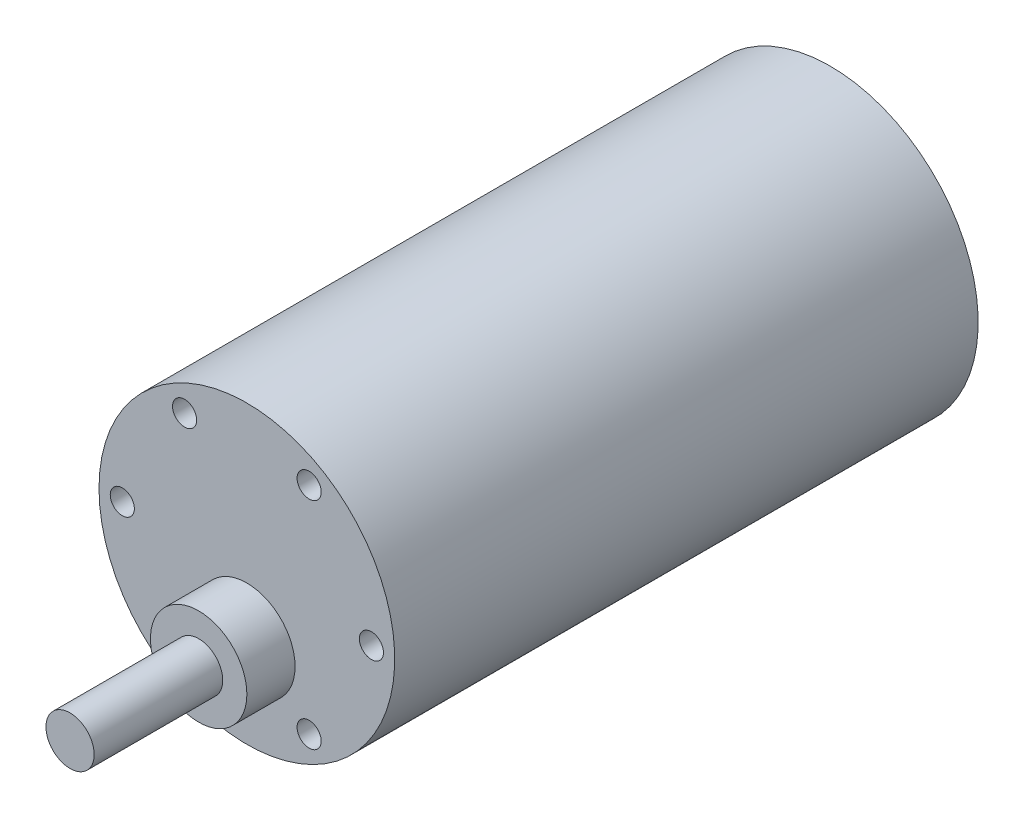
ISO-10303-21;
HEADER;
FILE_DESCRIPTION(('STEP AP214'),'2;1');
FILE_NAME('part.step','',(''),(''),'','','');
FILE_SCHEMA(('AUTOMOTIVE_DESIGN { 1 0 10303 214 1 1 1 1 }'));
ENDSEC;
DATA;
#1=APPLICATION_CONTEXT('core data for automotive mechanical design processes');
#2=APPLICATION_PROTOCOL_DEFINITION('international standard','automotive_design',2000,#1);
#3=PRODUCT_CONTEXT('',#1,'mechanical');
#4=PRODUCT('Part','Part','',(#3));
#5=PRODUCT_RELATED_PRODUCT_CATEGORY('part','',(#4));
#6=PRODUCT_DEFINITION_FORMATION('','',#4);
#7=PRODUCT_DEFINITION_CONTEXT('part definition',#1,'design');
#8=PRODUCT_DEFINITION('design','',#6,#7);
#9=PRODUCT_DEFINITION_SHAPE('','',#8);
#10=(LENGTH_UNIT() NAMED_UNIT(*) SI_UNIT(.MILLI.,.METRE.));
#11=(NAMED_UNIT(*) PLANE_ANGLE_UNIT() SI_UNIT($,.RADIAN.));
#12=(NAMED_UNIT(*) SI_UNIT($,.STERADIAN.) SOLID_ANGLE_UNIT());
#13=UNCERTAINTY_MEASURE_WITH_UNIT(LENGTH_MEASURE(1.E-05),#10,'distance_accuracy_value','');
#14=(GEOMETRIC_REPRESENTATION_CONTEXT(3) GLOBAL_UNCERTAINTY_ASSIGNED_CONTEXT((#13)) GLOBAL_UNIT_ASSIGNED_CONTEXT((#10,
#11,#12)) REPRESENTATION_CONTEXT('',''));
#15=CARTESIAN_POINT('',(0.,0.,0.));
#16=DIRECTION('',(0.,0.,1.));
#17=DIRECTION('',(1.,0.,0.));
#18=AXIS2_PLACEMENT_3D('',#15,#16,#17);
#19=CARTESIAN_POINT('',(0.,-7.00000010430813,22.));
#20=DIRECTION('',(0.,0.,1.));
#21=DIRECTION('',(1.,0.,0.));
#22=AXIS2_PLACEMENT_3D('',#19,#20,#21);
#23=PLANE('',#22);
#24=CARTESIAN_POINT('',(0.,-7.00000010430813,22.));
#25=DIRECTION('',(0.,0.,1.));
#26=DIRECTION('',(1.,0.,0.));
#27=AXIS2_PLACEMENT_3D('',#24,#25,#26);
#28=CIRCLE('',#27,3.);
#29=CARTESIAN_POINT('',(3.,-7.00000010430813,22.));
#30=VERTEX_POINT('',#29);
#31=EDGE_CURVE('E18',#30,#30,#28,.F.);
#32=ORIENTED_EDGE('',*,*,#31,.F.);
#33=EDGE_LOOP('',(#32));
#34=FACE_BOUND('',#33,.T.);
#35=ADVANCED_FACE('F15',(#34),#23,.T.);
#36=CARTESIAN_POINT('',(0.,-7.00000010430813,0.));
#37=DIRECTION('',(0.,0.,1.));
#38=DIRECTION('',(1.,0.,0.));
#39=AXIS2_PLACEMENT_3D('',#36,#37,#38);
#40=CYLINDRICAL_SURFACE('',#39,3.);
#41=CARTESIAN_POINT('',(0.,-7.00000010430813,6.));
#42=DIRECTION('',(0.,0.,1.));
#43=DIRECTION('',(1.,0.,0.));
#44=AXIS2_PLACEMENT_3D('',#41,#42,#43);
#45=CIRCLE('',#44,3.);
#46=CARTESIAN_POINT('',(3.,-7.00000010430813,6.));
#47=VERTEX_POINT('',#46);
#48=EDGE_CURVE('E70',#47,#47,#45,.F.);
#49=ORIENTED_EDGE('',*,*,#48,.F.);
#50=EDGE_LOOP('',(#49));
#51=FACE_BOUND('',#50,.T.);
#52=ORIENTED_EDGE('',*,*,#31,.T.);
#53=EDGE_LOOP('',(#52));
#54=FACE_BOUND('',#53,.T.);
#55=ADVANCED_FACE('F77',(#51,#54),#40,.T.);
#56=CARTESIAN_POINT('',(15.5,0.,-3.));
#57=DIRECTION('',(0.,0.,1.));
#58=DIRECTION('',(1.,0.,0.));
#59=AXIS2_PLACEMENT_3D('',#56,#57,#58);
#60=PLANE('',#59);
#61=CARTESIAN_POINT('',(15.5,0.,-3.));
#62=DIRECTION('',(0.,0.,-1.));
#63=DIRECTION('',(-1.,0.,0.));
#64=AXIS2_PLACEMENT_3D('',#61,#62,#63);
#65=CIRCLE('',#64,1.5);
#66=CARTESIAN_POINT('',(14.,0.,-3.));
#67=VERTEX_POINT('',#66);
#68=EDGE_CURVE('E68',#67,#67,#65,.F.);
#69=ORIENTED_EDGE('',*,*,#68,.T.);
#70=EDGE_LOOP('',(#69));
#71=FACE_BOUND('',#70,.T.);
#72=ADVANCED_FACE('F84',(#71),#60,.T.);
#73=CARTESIAN_POINT('',(-15.5,0.,-3.));
#74=DIRECTION('',(0.,0.,1.));
#75=DIRECTION('',(1.,0.,0.));
#76=AXIS2_PLACEMENT_3D('',#73,#74,#75);
#77=PLANE('',#76);
#78=CARTESIAN_POINT('',(-15.5,0.,-3.));
#79=DIRECTION('',(0.,0.,-1.));
#80=DIRECTION('',(-1.,0.,0.));
#81=AXIS2_PLACEMENT_3D('',#78,#79,#80);
#82=CIRCLE('',#81,1.5);
#83=CARTESIAN_POINT('',(-17.,0.,-3.));
#84=VERTEX_POINT('',#83);
#85=EDGE_CURVE('E65',#84,#84,#82,.F.);
#86=ORIENTED_EDGE('',*,*,#85,.T.);
#87=EDGE_LOOP('',(#86));
#88=FACE_BOUND('',#87,.T.);
#89=ADVANCED_FACE('F147',(#88),#77,.T.);
#90=CARTESIAN_POINT('',(-7.75,-13.4233937586588,-3.));
#91=DIRECTION('',(0.,0.,1.));
#92=DIRECTION('',(1.,0.,0.));
#93=AXIS2_PLACEMENT_3D('',#90,#91,#92);
#94=PLANE('',#93);
#95=CARTESIAN_POINT('',(-7.75,-13.4233937586588,-3.));
#96=DIRECTION('',(0.,0.,-1.));
#97=DIRECTION('',(-1.,0.,0.));
#98=AXIS2_PLACEMENT_3D('',#95,#96,#97);
#99=CIRCLE('',#98,1.5);
#100=CARTESIAN_POINT('',(-9.25,-13.4233937586588,-3.));
#101=VERTEX_POINT('',#100);
#102=EDGE_CURVE('E62',#101,#101,#99,.F.);
#103=ORIENTED_EDGE('',*,*,#102,.T.);
#104=EDGE_LOOP('',(#103));
#105=FACE_BOUND('',#104,.T.);
#106=ADVANCED_FACE('F143',(#105),#94,.T.);
#107=CARTESIAN_POINT('',(7.75,13.4233937586588,-3.));
#108=DIRECTION('',(0.,0.,1.));
#109=DIRECTION('',(1.,0.,0.));
#110=AXIS2_PLACEMENT_3D('',#107,#108,#109);
#111=PLANE('',#110);
#112=CARTESIAN_POINT('',(7.75,13.4233937586588,-3.));
#113=DIRECTION('',(0.,0.,-1.));
#114=DIRECTION('',(-1.,0.,0.));
#115=AXIS2_PLACEMENT_3D('',#112,#113,#114);
#116=CIRCLE('',#115,1.5);
#117=CARTESIAN_POINT('',(6.25,13.4233937586588,-3.));
#118=VERTEX_POINT('',#117);
#119=EDGE_CURVE('E59',#118,#118,#116,.F.);
#120=ORIENTED_EDGE('',*,*,#119,.T.);
#121=EDGE_LOOP('',(#120));
#122=FACE_BOUND('',#121,.T.);
#123=ADVANCED_FACE('F139',(#122),#111,.T.);
#124=CARTESIAN_POINT('',(-7.75,13.4233937586588,-3.));
#125=DIRECTION('',(0.,0.,1.));
#126=DIRECTION('',(1.,0.,0.));
#127=AXIS2_PLACEMENT_3D('',#124,#125,#126);
#128=PLANE('',#127);
#129=CARTESIAN_POINT('',(-7.75,13.4233937586588,-3.));
#130=DIRECTION('',(0.,0.,-1.));
#131=DIRECTION('',(-1.,0.,0.));
#132=AXIS2_PLACEMENT_3D('',#129,#130,#131);
#133=CIRCLE('',#132,1.5);
#134=CARTESIAN_POINT('',(-9.25,13.4233937586588,-3.));
#135=VERTEX_POINT('',#134);
#136=EDGE_CURVE('E56',#135,#135,#133,.F.);
#137=ORIENTED_EDGE('',*,*,#136,.T.);
#138=EDGE_LOOP('',(#137));
#139=FACE_BOUND('',#138,.T.);
#140=ADVANCED_FACE('F135',(#139),#128,.T.);
#141=CARTESIAN_POINT('',(7.74999999999999,-13.4233937586588,-3.));
#142=DIRECTION('',(0.,0.,1.));
#143=DIRECTION('',(1.,0.,0.));
#144=AXIS2_PLACEMENT_3D('',#141,#142,#143);
#145=PLANE('',#144);
#146=CARTESIAN_POINT('',(7.74999999999999,-13.4233937586588,-3.));
#147=DIRECTION('',(0.,0.,-1.));
#148=DIRECTION('',(-1.,0.,0.));
#149=AXIS2_PLACEMENT_3D('',#146,#147,#148);
#150=CIRCLE('',#149,1.5);
#151=CARTESIAN_POINT('',(6.24999999999999,-13.4233937586588,-3.));
#152=VERTEX_POINT('',#151);
#153=EDGE_CURVE('E53',#152,#152,#150,.F.);
#154=ORIENTED_EDGE('',*,*,#153,.T.);
#155=EDGE_LOOP('',(#154));
#156=FACE_BOUND('',#155,.T.);
#157=ADVANCED_FACE('F132',(#156),#145,.T.);
#158=CARTESIAN_POINT('',(0.,-7.00000010430813,6.));
#159=DIRECTION('',(0.,0.,1.));
#160=DIRECTION('',(1.,0.,0.));
#161=AXIS2_PLACEMENT_3D('',#158,#159,#160);
#162=PLANE('',#161);
#163=ORIENTED_EDGE('',*,*,#48,.T.);
#164=EDGE_LOOP('',(#163));
#165=FACE_BOUND('',#164,.T.);
#166=CARTESIAN_POINT('',(0.,-7.00000010430813,6.));
#167=DIRECTION('',(0.,0.,1.));
#168=DIRECTION('',(1.,0.,0.));
#169=AXIS2_PLACEMENT_3D('',#166,#167,#168);
#170=CIRCLE('',#169,6.);
#171=CARTESIAN_POINT('',(6.,-7.00000010430813,6.));
#172=VERTEX_POINT('',#171);
#173=EDGE_CURVE('E50',#172,#172,#170,.F.);
#174=ORIENTED_EDGE('',*,*,#173,.F.);
#175=EDGE_LOOP('',(#174));
#176=FACE_BOUND('',#175,.T.);
#177=ADVANCED_FACE('F128',(#165,#176),#162,.T.);
#178=CARTESIAN_POINT('',(15.5,0.,0.));
#179=DIRECTION('',(0.,0.,-1.));
#180=DIRECTION('',(-1.,0.,0.));
#181=AXIS2_PLACEMENT_3D('',#178,#179,#180);
#182=CYLINDRICAL_SURFACE('',#181,1.5);
#183=ORIENTED_EDGE('',*,*,#68,.F.);
#184=EDGE_LOOP('',(#183));
#185=FACE_BOUND('',#184,.T.);
#186=CARTESIAN_POINT('',(15.5,0.,0.));
#187=DIRECTION('',(0.,0.,-1.));
#188=DIRECTION('',(-1.,0.,0.));
#189=AXIS2_PLACEMENT_3D('',#186,#187,#188);
#190=CIRCLE('',#189,1.5);
#191=CARTESIAN_POINT('',(14.,0.,0.));
#192=VERTEX_POINT('',#191);
#193=EDGE_CURVE('E47',#192,#192,#190,.T.);
#194=ORIENTED_EDGE('',*,*,#193,.F.);
#195=EDGE_LOOP('',(#194));
#196=FACE_BOUND('',#195,.T.);
#197=ADVANCED_FACE('F124',(#185,#196),#182,.F.);
#198=CARTESIAN_POINT('',(-15.5,0.,0.));
#199=DIRECTION('',(0.,0.,-1.));
#200=DIRECTION('',(-1.,0.,0.));
#201=AXIS2_PLACEMENT_3D('',#198,#199,#200);
#202=CYLINDRICAL_SURFACE('',#201,1.5);
#203=ORIENTED_EDGE('',*,*,#85,.F.);
#204=EDGE_LOOP('',(#203));
#205=FACE_BOUND('',#204,.T.);
#206=CARTESIAN_POINT('',(-15.5,0.,0.));
#207=DIRECTION('',(0.,0.,-1.));
#208=DIRECTION('',(-1.,0.,0.));
#209=AXIS2_PLACEMENT_3D('',#206,#207,#208);
#210=CIRCLE('',#209,1.5);
#211=CARTESIAN_POINT('',(-17.,0.,0.));
#212=VERTEX_POINT('',#211);
#213=EDGE_CURVE('E44',#212,#212,#210,.T.);
#214=ORIENTED_EDGE('',*,*,#213,.F.);
#215=EDGE_LOOP('',(#214));
#216=FACE_BOUND('',#215,.T.);
#217=ADVANCED_FACE('F120',(#205,#216),#202,.F.);
#218=CARTESIAN_POINT('',(-7.75,-13.4233937586588,0.));
#219=DIRECTION('',(0.,0.,-1.));
#220=DIRECTION('',(-1.,0.,0.));
#221=AXIS2_PLACEMENT_3D('',#218,#219,#220);
#222=CYLINDRICAL_SURFACE('',#221,1.5);
#223=ORIENTED_EDGE('',*,*,#102,.F.);
#224=EDGE_LOOP('',(#223));
#225=FACE_BOUND('',#224,.T.);
#226=CARTESIAN_POINT('',(-7.75,-13.4233937586588,0.));
#227=DIRECTION('',(0.,0.,-1.));
#228=DIRECTION('',(-1.,0.,0.));
#229=AXIS2_PLACEMENT_3D('',#226,#227,#228);
#230=CIRCLE('',#229,1.5);
#231=CARTESIAN_POINT('',(-9.25,-13.4233937586588,0.));
#232=VERTEX_POINT('',#231);
#233=EDGE_CURVE('E41',#232,#232,#230,.T.);
#234=ORIENTED_EDGE('',*,*,#233,.F.);
#235=EDGE_LOOP('',(#234));
#236=FACE_BOUND('',#235,.T.);
#237=ADVANCED_FACE('F116',(#225,#236),#222,.F.);
#238=CARTESIAN_POINT('',(7.75,13.4233937586588,0.));
#239=DIRECTION('',(0.,0.,-1.));
#240=DIRECTION('',(-1.,0.,0.));
#241=AXIS2_PLACEMENT_3D('',#238,#239,#240);
#242=CYLINDRICAL_SURFACE('',#241,1.5);
#243=ORIENTED_EDGE('',*,*,#119,.F.);
#244=EDGE_LOOP('',(#243));
#245=FACE_BOUND('',#244,.T.);
#246=CARTESIAN_POINT('',(7.75,13.4233937586588,0.));
#247=DIRECTION('',(0.,0.,-1.));
#248=DIRECTION('',(-1.,0.,0.));
#249=AXIS2_PLACEMENT_3D('',#246,#247,#248);
#250=CIRCLE('',#249,1.5);
#251=CARTESIAN_POINT('',(6.25,13.4233937586588,0.));
#252=VERTEX_POINT('',#251);
#253=EDGE_CURVE('E38',#252,#252,#250,.T.);
#254=ORIENTED_EDGE('',*,*,#253,.F.);
#255=EDGE_LOOP('',(#254));
#256=FACE_BOUND('',#255,.T.);
#257=ADVANCED_FACE('F112',(#245,#256),#242,.F.);
#258=CARTESIAN_POINT('',(-7.75,13.4233937586588,0.));
#259=DIRECTION('',(0.,0.,-1.));
#260=DIRECTION('',(-1.,0.,0.));
#261=AXIS2_PLACEMENT_3D('',#258,#259,#260);
#262=CYLINDRICAL_SURFACE('',#261,1.5);
#263=ORIENTED_EDGE('',*,*,#136,.F.);
#264=EDGE_LOOP('',(#263));
#265=FACE_BOUND('',#264,.T.);
#266=CARTESIAN_POINT('',(-7.75,13.4233937586588,0.));
#267=DIRECTION('',(0.,0.,-1.));
#268=DIRECTION('',(-1.,0.,0.));
#269=AXIS2_PLACEMENT_3D('',#266,#267,#268);
#270=CIRCLE('',#269,1.5);
#271=CARTESIAN_POINT('',(-9.25,13.4233937586588,0.));
#272=VERTEX_POINT('',#271);
#273=EDGE_CURVE('E35',#272,#272,#270,.T.);
#274=ORIENTED_EDGE('',*,*,#273,.F.);
#275=EDGE_LOOP('',(#274));
#276=FACE_BOUND('',#275,.T.);
#277=ADVANCED_FACE('F108',(#265,#276),#262,.F.);
#278=CARTESIAN_POINT('',(7.74999999999999,-13.4233937586588,0.));
#279=DIRECTION('',(0.,0.,-1.));
#280=DIRECTION('',(-1.,0.,0.));
#281=AXIS2_PLACEMENT_3D('',#278,#279,#280);
#282=CYLINDRICAL_SURFACE('',#281,1.5);
#283=ORIENTED_EDGE('',*,*,#153,.F.);
#284=EDGE_LOOP('',(#283));
#285=FACE_BOUND('',#284,.T.);
#286=CARTESIAN_POINT('',(7.74999999999999,-13.4233937586588,0.));
#287=DIRECTION('',(0.,0.,-1.));
#288=DIRECTION('',(-1.,0.,0.));
#289=AXIS2_PLACEMENT_3D('',#286,#287,#288);
#290=CIRCLE('',#289,1.5);
#291=CARTESIAN_POINT('',(6.24999999999999,-13.4233937586588,0.));
#292=VERTEX_POINT('',#291);
#293=EDGE_CURVE('E32',#292,#292,#290,.T.);
#294=ORIENTED_EDGE('',*,*,#293,.F.);
#295=EDGE_LOOP('',(#294));
#296=FACE_BOUND('',#295,.T.);
#297=ADVANCED_FACE('F104',(#285,#296),#282,.F.);
#298=CARTESIAN_POINT('',(0.,-7.00000010430813,0.));
#299=DIRECTION('',(0.,0.,1.));
#300=DIRECTION('',(1.,0.,0.));
#301=AXIS2_PLACEMENT_3D('',#298,#299,#300);
#302=CYLINDRICAL_SURFACE('',#301,6.);
#303=CARTESIAN_POINT('',(0.,-7.00000010430813,0.));
#304=DIRECTION('',(0.,0.,1.));
#305=DIRECTION('',(1.,0.,0.));
#306=AXIS2_PLACEMENT_3D('',#303,#304,#305);
#307=CIRCLE('',#306,6.);
#308=CARTESIAN_POINT('',(6.,-7.00000010430813,0.));
#309=VERTEX_POINT('',#308);
#310=EDGE_CURVE('E27',#309,#309,#307,.F.);
#311=ORIENTED_EDGE('',*,*,#310,.F.);
#312=EDGE_LOOP('',(#311));
#313=FACE_BOUND('',#312,.T.);
#314=ORIENTED_EDGE('',*,*,#173,.T.);
#315=EDGE_LOOP('',(#314));
#316=FACE_BOUND('',#315,.T.);
#317=ADVANCED_FACE('F100',(#313,#316),#302,.T.);
#318=CARTESIAN_POINT('',(0.,0.,-72.6));
#319=DIRECTION('',(0.,0.,1.));
#320=DIRECTION('',(1.,0.,0.));
#321=AXIS2_PLACEMENT_3D('',#318,#319,#320);
#322=PLANE('',#321);
#323=CARTESIAN_POINT('',(0.,0.,-72.6));
#324=DIRECTION('',(0.,0.,-1.));
#325=DIRECTION('',(-1.,0.,0.));
#326=AXIS2_PLACEMENT_3D('',#323,#324,#325);
#327=CIRCLE('',#326,18.4);
#328=CARTESIAN_POINT('',(-18.4,0.,-72.6));
#329=VERTEX_POINT('',#328);
#330=EDGE_CURVE('E22',#329,#329,#327,.F.);
#331=ORIENTED_EDGE('',*,*,#330,.F.);
#332=EDGE_LOOP('',(#331));
#333=FACE_BOUND('',#332,.T.);
#334=ADVANCED_FACE('F93',(#333),#322,.F.);
#335=CARTESIAN_POINT('',(0.,0.,0.));
#336=DIRECTION('',(0.,0.,1.));
#337=DIRECTION('',(1.,0.,0.));
#338=AXIS2_PLACEMENT_3D('',#335,#336,#337);
#339=PLANE('',#338);
#340=ORIENTED_EDGE('',*,*,#310,.T.);
#341=EDGE_LOOP('',(#340));
#342=FACE_BOUND('',#341,.T.);
#343=ORIENTED_EDGE('',*,*,#293,.T.);
#344=EDGE_LOOP('',(#343));
#345=FACE_BOUND('',#344,.T.);
#346=ORIENTED_EDGE('',*,*,#273,.T.);
#347=EDGE_LOOP('',(#346));
#348=FACE_BOUND('',#347,.T.);
#349=ORIENTED_EDGE('',*,*,#253,.T.);
#350=EDGE_LOOP('',(#349));
#351=FACE_BOUND('',#350,.T.);
#352=ORIENTED_EDGE('',*,*,#233,.T.);
#353=EDGE_LOOP('',(#352));
#354=FACE_BOUND('',#353,.T.);
#355=ORIENTED_EDGE('',*,*,#213,.T.);
#356=EDGE_LOOP('',(#355));
#357=FACE_BOUND('',#356,.T.);
#358=ORIENTED_EDGE('',*,*,#193,.T.);
#359=EDGE_LOOP('',(#358));
#360=FACE_BOUND('',#359,.T.);
#361=CARTESIAN_POINT('',(0.,0.,0.));
#362=DIRECTION('',(0.,0.,-1.));
#363=DIRECTION('',(-1.,0.,0.));
#364=AXIS2_PLACEMENT_3D('',#361,#362,#363);
#365=CIRCLE('',#364,18.4);
#366=CARTESIAN_POINT('',(-18.4,0.,0.));
#367=VERTEX_POINT('',#366);
#368=EDGE_CURVE('E10',#367,#367,#365,.T.);
#369=ORIENTED_EDGE('',*,*,#368,.F.);
#370=EDGE_LOOP('',(#369));
#371=FACE_BOUND('',#370,.T.);
#372=ADVANCED_FACE('F88',(#342,#345,#348,#351,#354,#357,#360,#371),#339,.T.);
#373=CARTESIAN_POINT('',(0.,0.,0.));
#374=DIRECTION('',(0.,0.,-1.));
#375=DIRECTION('',(-1.,0.,0.));
#376=AXIS2_PLACEMENT_3D('',#373,#374,#375);
#377=CYLINDRICAL_SURFACE('',#376,18.4);
#378=ORIENTED_EDGE('',*,*,#368,.T.);
#379=EDGE_LOOP('',(#378));
#380=FACE_BOUND('',#379,.T.);
#381=ORIENTED_EDGE('',*,*,#330,.T.);
#382=EDGE_LOOP('',(#381));
#383=FACE_BOUND('',#382,.T.);
#384=ADVANCED_FACE('F86',(#380,#383),#377,.T.);
#385=CLOSED_SHELL('',(#35,#55,#72,#89,#106,#123,#140,#157,#177,#197,#217,#237,#257,#277,#297,
#317,#334,#372,#384));
#386=MANIFOLD_SOLID_BREP('B1',#385);
#387=ADVANCED_BREP_SHAPE_REPRESENTATION('',(#18,#386),#14);
#388=SHAPE_DEFINITION_REPRESENTATION(#9,#387);
ENDSEC;
END-ISO-10303-21;
